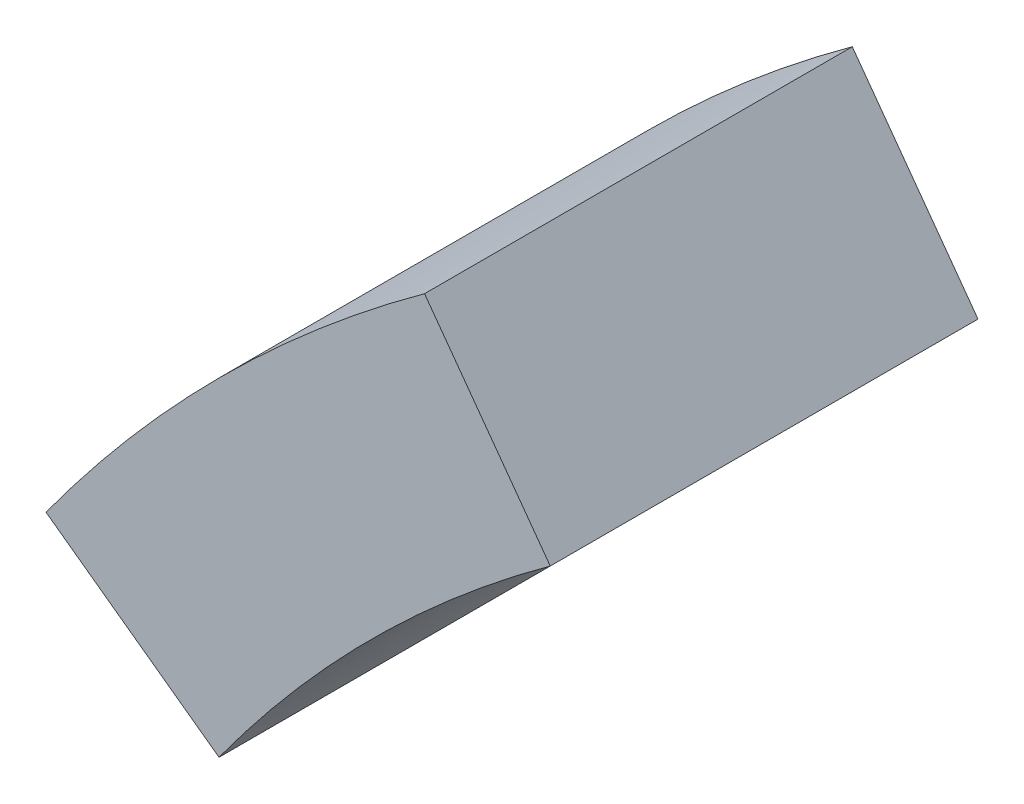
ISO-10303-21;
HEADER;
FILE_DESCRIPTION(('STEP AP214'),'2;1');
FILE_NAME('part.step','',(''),(''),'','','');
FILE_SCHEMA(('AUTOMOTIVE_DESIGN { 1 0 10303 214 1 1 1 1 }'));
ENDSEC;
DATA;
#1=APPLICATION_CONTEXT('core data for automotive mechanical design processes');
#2=APPLICATION_PROTOCOL_DEFINITION('international standard','automotive_design',2000,#1);
#3=PRODUCT_CONTEXT('',#1,'mechanical');
#4=PRODUCT('Part','Part','',(#3));
#5=PRODUCT_RELATED_PRODUCT_CATEGORY('part','',(#4));
#6=PRODUCT_DEFINITION_FORMATION('','',#4);
#7=PRODUCT_DEFINITION_CONTEXT('part definition',#1,'design');
#8=PRODUCT_DEFINITION('design','',#6,#7);
#9=PRODUCT_DEFINITION_SHAPE('','',#8);
#10=(LENGTH_UNIT() NAMED_UNIT(*) SI_UNIT(.MILLI.,.METRE.));
#11=(NAMED_UNIT(*) PLANE_ANGLE_UNIT() SI_UNIT($,.RADIAN.));
#12=(NAMED_UNIT(*) SI_UNIT($,.STERADIAN.) SOLID_ANGLE_UNIT());
#13=UNCERTAINTY_MEASURE_WITH_UNIT(LENGTH_MEASURE(1.E-05),#10,'distance_accuracy_value','');
#14=(GEOMETRIC_REPRESENTATION_CONTEXT(3) GLOBAL_UNCERTAINTY_ASSIGNED_CONTEXT((#13)) GLOBAL_UNIT_ASSIGNED_CONTEXT((#10,
#11,#12)) REPRESENTATION_CONTEXT('',''));
#15=CARTESIAN_POINT('',(0.,0.,0.));
#16=DIRECTION('',(0.,0.,1.));
#17=DIRECTION('',(1.,0.,0.));
#18=AXIS2_PLACEMENT_3D('',#15,#16,#17);
#19=CARTESIAN_POINT('',(-2935.53586451216,-2132.79164805303,624.));
#20=DIRECTION('',(-0.809016994374951,-0.587785252292468,0.));
#21=DIRECTION('',(0.587785252292468,-0.809016994374951,0.));
#22=AXIS2_PLACEMENT_3D('',#19,#20,#21);
#23=PLANE('',#22);
#24=DIRECTION('',(-0.587785252292468,0.809016994374951,0.));
#25=VECTOR('',#24,1.);
#26=CARTESIAN_POINT('',(-2935.53586451216,-2132.79164805303,0.));
#27=LINE('',#26,#25);
#28=CARTESIAN_POINT('',(-9395.72299100676,6758.89311571489,0.));
#29=VERTEX_POINT('',#28);
#30=CARTESIAN_POINT('',(-9579.11198972201,7011.30641795987,0.));
#31=VERTEX_POINT('',#30);
#32=EDGE_CURVE('E102',#29,#31,#27,.T.);
#33=ORIENTED_EDGE('',*,*,#32,.T.);
#34=DIRECTION('',(0.,0.,-1.));
#35=VECTOR('',#34,1.);
#36=CARTESIAN_POINT('',(-9579.11198972201,7011.30641795987,624.));
#37=LINE('',#36,#35);
#38=CARTESIAN_POINT('',(-9579.11198972201,7011.30641795987,624.));
#39=VERTEX_POINT('',#38);
#40=EDGE_CURVE('E11',#39,#31,#37,.T.);
#41=ORIENTED_EDGE('',*,*,#40,.F.);
#42=DIRECTION('',(-0.587785252292468,0.809016994374951,0.));
#43=VECTOR('',#42,1.);
#44=CARTESIAN_POINT('',(-2935.53586451216,-2132.79164805303,624.));
#45=LINE('',#44,#43);
#46=CARTESIAN_POINT('',(-9395.72299100676,6758.89311571489,624.));
#47=VERTEX_POINT('',#46);
#48=EDGE_CURVE('E88',#47,#39,#45,.T.);
#49=ORIENTED_EDGE('',*,*,#48,.F.);
#50=DIRECTION('',(0.,0.,-1.));
#51=VECTOR('',#50,1.);
#52=CARTESIAN_POINT('',(-9395.72299100676,6758.89311571489,624.));
#53=LINE('',#52,#51);
#54=EDGE_CURVE('E55',#47,#29,#53,.T.);
#55=ORIENTED_EDGE('',*,*,#54,.T.);
#56=EDGE_LOOP('',(#33,#41,#49,#55));
#57=FACE_BOUND('',#56,.T.);
#58=ADVANCED_FACE('F39',(#57),#23,.F.);
#59=CARTESIAN_POINT('',(-8112.,4992.,624.));
#60=DIRECTION('',(0.,0.,-1.));
#61=DIRECTION('',(-1.,0.,0.));
#62=AXIS2_PLACEMENT_3D('',#59,#60,#61);
#63=CYLINDRICAL_SURFACE('',#62,2496.);
#64=CARTESIAN_POINT('',(-8112.,4992.,0.));
#65=DIRECTION('',(0.,0.,1.));
#66=DIRECTION('',(1.,0.,0.));
#67=AXIS2_PLACEMENT_3D('',#64,#65,#66);
#68=CIRCLE('',#67,2496.);
#69=CARTESIAN_POINT('',(-10131.3064179599,6459.11198972201,0.));
#70=VERTEX_POINT('',#69);
#71=EDGE_CURVE('E93',#31,#70,#68,.T.);
#72=ORIENTED_EDGE('',*,*,#71,.T.);
#73=DIRECTION('',(0.,0.,-1.));
#74=VECTOR('',#73,1.);
#75=CARTESIAN_POINT('',(-10131.3064179599,6459.11198972201,624.));
#76=LINE('',#75,#74);
#77=CARTESIAN_POINT('',(-10131.3064179599,6459.11198972201,624.));
#78=VERTEX_POINT('',#77);
#79=EDGE_CURVE('E47',#78,#70,#76,.T.);
#80=ORIENTED_EDGE('',*,*,#79,.F.);
#81=CARTESIAN_POINT('',(-8112.,4992.,624.));
#82=DIRECTION('',(0.,0.,1.));
#83=DIRECTION('',(1.,0.,0.));
#84=AXIS2_PLACEMENT_3D('',#81,#82,#83);
#85=CIRCLE('',#84,2496.);
#86=EDGE_CURVE('E80',#39,#78,#85,.T.);
#87=ORIENTED_EDGE('',*,*,#86,.F.);
#88=ORIENTED_EDGE('',*,*,#40,.T.);
#89=EDGE_LOOP('',(#72,#80,#87,#88));
#90=FACE_BOUND('',#89,.T.);
#91=ADVANCED_FACE('F92',(#90),#63,.T.);
#92=CARTESIAN_POINT('',(-428.79000614256,-590.178812133335,624.));
#93=DIRECTION('',(-0.587785252292478,-0.809016994374944,0.));
#94=DIRECTION('',(0.809016994374944,-0.587785252292478,0.));
#95=AXIS2_PLACEMENT_3D('',#92,#93,#94);
#96=PLANE('',#95);
#97=DIRECTION('',(-0.809016994374944,0.587785252292479,0.));
#98=VECTOR('',#97,1.);
#99=CARTESIAN_POINT('',(-428.79000614256,-590.178812133335,0.));
#100=LINE('',#99,#98);
#101=CARTESIAN_POINT('',(-9878.89311571489,6275.72299100676,0.));
#102=VERTEX_POINT('',#101);
#103=EDGE_CURVE('E105',#102,#70,#100,.T.);
#104=ORIENTED_EDGE('',*,*,#103,.F.);
#105=DIRECTION('',(0.,0.,-1.));
#106=VECTOR('',#105,1.);
#107=CARTESIAN_POINT('',(-9878.89311571489,6275.72299100676,624.));
#108=LINE('',#107,#106);
#109=CARTESIAN_POINT('',(-9878.89311571489,6275.72299100676,624.));
#110=VERTEX_POINT('',#109);
#111=EDGE_CURVE('E69',#110,#102,#108,.T.);
#112=ORIENTED_EDGE('',*,*,#111,.F.);
#113=DIRECTION('',(-0.809016994374944,0.587785252292479,0.));
#114=VECTOR('',#113,1.);
#115=CARTESIAN_POINT('',(-428.79000614256,-590.178812133335,624.));
#116=LINE('',#115,#114);
#117=EDGE_CURVE('E87',#110,#78,#116,.T.);
#118=ORIENTED_EDGE('',*,*,#117,.T.);
#119=ORIENTED_EDGE('',*,*,#79,.T.);
#120=EDGE_LOOP('',(#104,#112,#118,#119));
#121=FACE_BOUND('',#120,.T.);
#122=ADVANCED_FACE('F96',(#121),#96,.T.);
#123=CARTESIAN_POINT('',(-8112.,4992.,624.));
#124=DIRECTION('',(0.,0.,-1.));
#125=DIRECTION('',(-1.,0.,0.));
#126=AXIS2_PLACEMENT_3D('',#123,#124,#125);
#127=CYLINDRICAL_SURFACE('',#126,2184.);
#128=CARTESIAN_POINT('',(-8112.,4992.,0.));
#129=DIRECTION('',(0.,0.,1.));
#130=DIRECTION('',(1.,0.,0.));
#131=AXIS2_PLACEMENT_3D('',#128,#129,#130);
#132=CIRCLE('',#131,2184.);
#133=EDGE_CURVE('E107',#29,#102,#132,.T.);
#134=ORIENTED_EDGE('',*,*,#133,.F.);
#135=ORIENTED_EDGE('',*,*,#54,.F.);
#136=CARTESIAN_POINT('',(-8112.,4992.,624.));
#137=DIRECTION('',(0.,0.,1.));
#138=DIRECTION('',(1.,0.,0.));
#139=AXIS2_PLACEMENT_3D('',#136,#137,#138);
#140=CIRCLE('',#139,2184.);
#141=EDGE_CURVE('E97',#47,#110,#140,.T.);
#142=ORIENTED_EDGE('',*,*,#141,.T.);
#143=ORIENTED_EDGE('',*,*,#111,.T.);
#144=EDGE_LOOP('',(#134,#135,#142,#143));
#145=FACE_BOUND('',#144,.T.);
#146=ADVANCED_FACE('F113',(#145),#127,.F.);
#147=CARTESIAN_POINT('',(0.,0.,624.));
#148=DIRECTION('',(0.,0.,1.));
#149=DIRECTION('',(1.,0.,0.));
#150=AXIS2_PLACEMENT_3D('',#147,#148,#149);
#151=PLANE('',#150);
#152=ORIENTED_EDGE('',*,*,#48,.T.);
#153=ORIENTED_EDGE('',*,*,#86,.T.);
#154=ORIENTED_EDGE('',*,*,#117,.F.);
#155=ORIENTED_EDGE('',*,*,#141,.F.);
#156=EDGE_LOOP('',(#152,#153,#154,#155));
#157=FACE_BOUND('',#156,.T.);
#158=ADVANCED_FACE('F84',(#157),#151,.T.);
#159=CARTESIAN_POINT('',(0.,0.,0.));
#160=DIRECTION('',(0.,0.,1.));
#161=DIRECTION('',(1.,0.,0.));
#162=AXIS2_PLACEMENT_3D('',#159,#160,#161);
#163=PLANE('',#162);
#164=ORIENTED_EDGE('',*,*,#32,.F.);
#165=ORIENTED_EDGE('',*,*,#133,.T.);
#166=ORIENTED_EDGE('',*,*,#103,.T.);
#167=ORIENTED_EDGE('',*,*,#71,.F.);
#168=EDGE_LOOP('',(#164,#165,#166,#167));
#169=FACE_BOUND('',#168,.T.);
#170=ADVANCED_FACE('F112',(#169),#163,.F.);
#171=CLOSED_SHELL('',(#58,#91,#122,#146,#158,#170));
#172=MANIFOLD_SOLID_BREP('B2',#171);
#173=ADVANCED_BREP_SHAPE_REPRESENTATION('',(#18,#172),#14);
#174=SHAPE_DEFINITION_REPRESENTATION(#9,#173);
ENDSEC;
END-ISO-10303-21;
